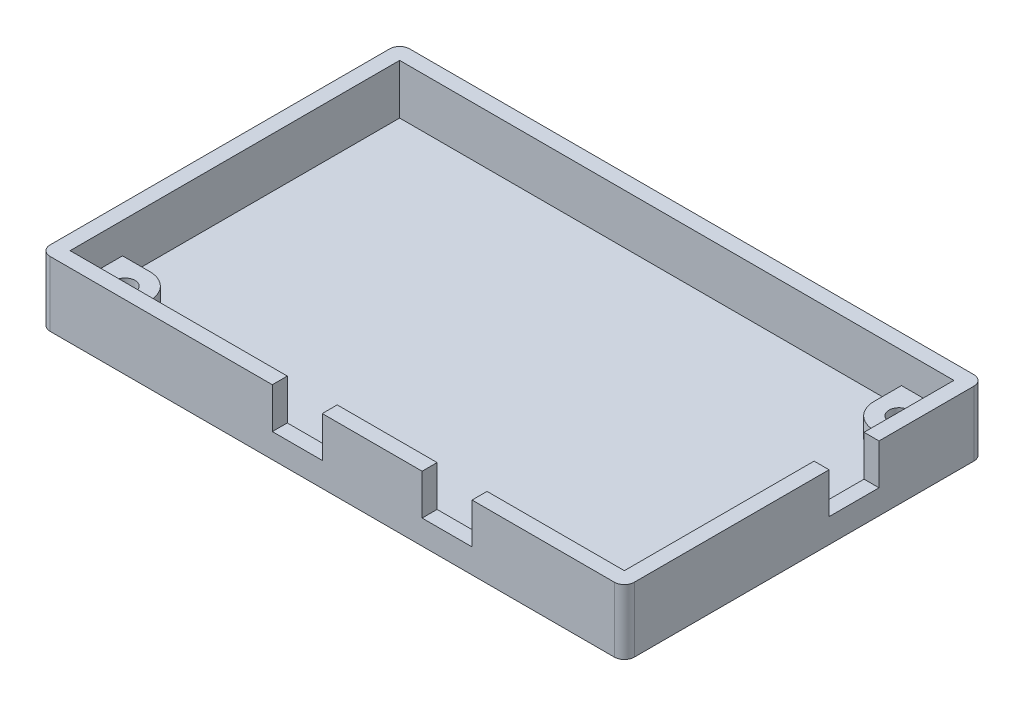
ISO-10303-21;
HEADER;
FILE_DESCRIPTION(('STEP AP214'),'2;1');
FILE_NAME('part.step','',(''),(''),'','','');
FILE_SCHEMA(('AUTOMOTIVE_DESIGN { 1 0 10303 214 1 1 1 1 }'));
ENDSEC;
DATA;
#1=APPLICATION_CONTEXT('core data for automotive mechanical design processes');
#2=APPLICATION_PROTOCOL_DEFINITION('international standard','automotive_design',2000,#1);
#3=PRODUCT_CONTEXT('',#1,'mechanical');
#4=PRODUCT('Part','Part','',(#3));
#5=PRODUCT_RELATED_PRODUCT_CATEGORY('part','',(#4));
#6=PRODUCT_DEFINITION_FORMATION('','',#4);
#7=PRODUCT_DEFINITION_CONTEXT('part definition',#1,'design');
#8=PRODUCT_DEFINITION('design','',#6,#7);
#9=PRODUCT_DEFINITION_SHAPE('','',#8);
#10=(LENGTH_UNIT() NAMED_UNIT(*) SI_UNIT(.MILLI.,.METRE.));
#11=(NAMED_UNIT(*) PLANE_ANGLE_UNIT() SI_UNIT($,.RADIAN.));
#12=(NAMED_UNIT(*) SI_UNIT($,.STERADIAN.) SOLID_ANGLE_UNIT());
#13=UNCERTAINTY_MEASURE_WITH_UNIT(LENGTH_MEASURE(1.E-05),#10,'distance_accuracy_value','');
#14=(GEOMETRIC_REPRESENTATION_CONTEXT(3) GLOBAL_UNCERTAINTY_ASSIGNED_CONTEXT((#13)) GLOBAL_UNIT_ASSIGNED_CONTEXT((#10,
#11,#12)) REPRESENTATION_CONTEXT('',''));
#15=CARTESIAN_POINT('',(0.,0.,0.));
#16=DIRECTION('',(0.,0.,1.));
#17=DIRECTION('',(1.,0.,0.));
#18=AXIS2_PLACEMENT_3D('',#15,#16,#17);
#19=CARTESIAN_POINT('',(0.,10.,0.));
#20=DIRECTION('',(0.,1.,0.));
#21=DIRECTION('',(0.,0.,1.));
#22=AXIS2_PLACEMENT_3D('',#19,#20,#21);
#23=PLANE('',#22);
#24=DIRECTION('',(0.,0.,-1.));
#25=VECTOR('',#24,1.);
#26=CARTESIAN_POINT('',(83.,10.,3.5));
#27=LINE('',#26,#25);
#28=CARTESIAN_POINT('',(83.,10.,3.5));
#29=VERTEX_POINT('',#28);
#30=CARTESIAN_POINT('',(83.,10.,0.5));
#31=VERTEX_POINT('',#30);
#32=EDGE_CURVE('E278',#29,#31,#27,.T.);
#33=ORIENTED_EDGE('',*,*,#32,.F.);
#34=DIRECTION('',(1.,0.,0.));
#35=VECTOR('',#34,1.);
#36=CARTESIAN_POINT('',(0.,10.,3.5));
#37=LINE('',#36,#35);
#38=CARTESIAN_POINT('',(111.5,10.,3.5));
#39=VERTEX_POINT('',#38);
#40=EDGE_CURVE('E268',#29,#39,#37,.T.);
#41=ORIENTED_EDGE('',*,*,#40,.T.);
#42=CARTESIAN_POINT('',(111.5,10.,1.5));
#43=DIRECTION('',(0.,1.,0.));
#44=DIRECTION('',(0.,0.,1.));
#45=AXIS2_PLACEMENT_3D('',#42,#43,#44);
#46=CIRCLE('',#45,2.);
#47=CARTESIAN_POINT('',(113.5,10.,1.5));
#48=VERTEX_POINT('',#47);
#49=EDGE_CURVE('E477',#39,#48,#46,.T.);
#50=ORIENTED_EDGE('',*,*,#49,.T.);
#51=DIRECTION('',(0.,0.,-1.));
#52=VECTOR('',#51,1.);
#53=CARTESIAN_POINT('',(113.5,10.,0.));
#54=LINE('',#53,#52);
#55=CARTESIAN_POINT('',(113.5,10.,-37.5));
#56=VERTEX_POINT('',#55);
#57=EDGE_CURVE('E415',#48,#56,#54,.T.);
#58=ORIENTED_EDGE('',*,*,#57,.T.);
#59=DIRECTION('',(-1.,0.,0.));
#60=VECTOR('',#59,1.);
#61=CARTESIAN_POINT('',(113.5,10.,-37.5));
#62=LINE('',#61,#60);
#63=CARTESIAN_POINT('',(110.5,10.,-37.5));
#64=VERTEX_POINT('',#63);
#65=EDGE_CURVE('E330',#56,#64,#62,.T.);
#66=ORIENTED_EDGE('',*,*,#65,.T.);
#67=DIRECTION('',(0.,0.,-1.));
#68=VECTOR('',#67,1.);
#69=CARTESIAN_POINT('',(110.5,10.,0.));
#70=LINE('',#69,#68);
#71=CARTESIAN_POINT('',(110.5,10.,0.5));
#72=VERTEX_POINT('',#71);
#73=EDGE_CURVE('E433',#72,#64,#70,.T.);
#74=ORIENTED_EDGE('',*,*,#73,.F.);
#75=DIRECTION('',(1.,0.,0.));
#76=VECTOR('',#75,1.);
#77=CARTESIAN_POINT('',(0.,10.,0.5));
#78=LINE('',#77,#76);
#79=EDGE_CURVE('E421',#31,#72,#78,.T.);
#80=ORIENTED_EDGE('',*,*,#79,.F.);
#81=EDGE_LOOP('',(#33,#41,#50,#58,#66,#74,#80));
#82=FACE_BOUND('',#81,.T.);
#83=ADVANCED_FACE('F39',(#82),#23,.T.);
#84=DIRECTION('',(0.,0.,-1.));
#85=VECTOR('',#84,1.);
#86=CARTESIAN_POINT('',(73.,10.,3.5));
#87=LINE('',#86,#85);
#88=CARTESIAN_POINT('',(73.,10.,3.5));
#89=VERTEX_POINT('',#88);
#90=CARTESIAN_POINT('',(73.,10.,0.5));
#91=VERTEX_POINT('',#90);
#92=EDGE_CURVE('E281',#89,#91,#87,.T.);
#93=ORIENTED_EDGE('',*,*,#92,.T.);
#94=CARTESIAN_POINT('',(53.,10.,0.5));
#95=VERTEX_POINT('',#94);
#96=EDGE_CURVE('E426',#95,#91,#78,.T.);
#97=ORIENTED_EDGE('',*,*,#96,.F.);
#98=DIRECTION('',(0.,0.,-1.));
#99=VECTOR('',#98,1.);
#100=CARTESIAN_POINT('',(53.,10.,3.5));
#101=LINE('',#100,#99);
#102=CARTESIAN_POINT('',(53.,10.,3.5));
#103=VERTEX_POINT('',#102);
#104=EDGE_CURVE('E276',#103,#95,#101,.T.);
#105=ORIENTED_EDGE('',*,*,#104,.F.);
#106=EDGE_CURVE('E414',#103,#89,#37,.T.);
#107=ORIENTED_EDGE('',*,*,#106,.T.);
#108=EDGE_LOOP('',(#93,#97,#105,#107));
#109=FACE_BOUND('',#108,.T.);
#110=ADVANCED_FACE('F544',(#109),#23,.T.);
#111=CARTESIAN_POINT('',(110.5,10.,0.));
#112=DIRECTION('',(-1.,0.,0.));
#113=DIRECTION('',(0.,0.,1.));
#114=AXIS2_PLACEMENT_3D('',#111,#112,#113);
#115=PLANE('',#114);
#116=ORIENTED_EDGE('',*,*,#73,.T.);
#117=DIRECTION('',(0.,-1.,0.));
#118=VECTOR('',#117,1.);
#119=CARTESIAN_POINT('',(110.5,10.,-37.5));
#120=LINE('',#119,#118);
#121=CARTESIAN_POINT('',(110.5,1.87,-37.5));
#122=VERTEX_POINT('',#121);
#123=EDGE_CURVE('E280',#64,#122,#120,.T.);
#124=ORIENTED_EDGE('',*,*,#123,.T.);
#125=DIRECTION('',(0.,0.,1.));
#126=VECTOR('',#125,1.);
#127=CARTESIAN_POINT('',(110.5,1.87,-47.5));
#128=LINE('',#127,#126);
#129=CARTESIAN_POINT('',(110.5,1.87,-47.5));
#130=VERTEX_POINT('',#129);
#131=EDGE_CURVE('E320',#130,#122,#128,.T.);
#132=ORIENTED_EDGE('',*,*,#131,.F.);
#133=DIRECTION('',(0.,-1.,0.));
#134=VECTOR('',#133,1.);
#135=CARTESIAN_POINT('',(110.5,10.,-47.5));
#136=LINE('',#135,#134);
#137=CARTESIAN_POINT('',(110.5,10.,-47.5));
#138=VERTEX_POINT('',#137);
#139=EDGE_CURVE('E311',#138,#130,#136,.T.);
#140=ORIENTED_EDGE('',*,*,#139,.F.);
#141=CARTESIAN_POINT('',(110.5,10.,-65.5));
#142=VERTEX_POINT('',#141);
#143=EDGE_CURVE('E432',#138,#142,#70,.T.);
#144=ORIENTED_EDGE('',*,*,#143,.T.);
#145=DIRECTION('',(0.,-1.,0.));
#146=VECTOR('',#145,1.);
#147=CARTESIAN_POINT('',(110.5,10.,-65.5));
#148=LINE('',#147,#146);
#149=CARTESIAN_POINT('',(110.5,3.85,-65.5));
#150=VERTEX_POINT('',#149);
#151=EDGE_CURVE('E447',#142,#150,#148,.T.);
#152=ORIENTED_EDGE('',*,*,#151,.T.);
#153=DIRECTION('',(0.,0.,-1.));
#154=VECTOR('',#153,1.);
#155=CARTESIAN_POINT('',(110.5,3.85,-65.5));
#156=LINE('',#155,#154);
#157=CARTESIAN_POINT('',(110.5,3.85,-55.));
#158=VERTEX_POINT('',#157);
#159=EDGE_CURVE('E379',#158,#150,#156,.T.);
#160=ORIENTED_EDGE('',*,*,#159,.F.);
#161=DIRECTION('',(0.,-1.,0.));
#162=VECTOR('',#161,1.);
#163=CARTESIAN_POINT('',(110.5,3.85,-55.));
#164=LINE('',#163,#162);
#165=CARTESIAN_POINT('',(110.5,0.,-55.));
#166=VERTEX_POINT('',#165);
#167=EDGE_CURVE('E390',#158,#166,#164,.T.);
#168=ORIENTED_EDGE('',*,*,#167,.T.);
#169=DIRECTION('',(0.,0.,-1.));
#170=VECTOR('',#169,1.);
#171=CARTESIAN_POINT('',(110.5,0.,0.));
#172=LINE('',#171,#170);
#173=CARTESIAN_POINT('',(110.5,0.,0.5));
#174=VERTEX_POINT('',#173);
#175=EDGE_CURVE('E409',#174,#166,#172,.T.);
#176=ORIENTED_EDGE('',*,*,#175,.F.);
#177=DIRECTION('',(0.,-1.,0.));
#178=VECTOR('',#177,1.);
#179=CARTESIAN_POINT('',(110.5,10.,0.5));
#180=LINE('',#179,#178);
#181=EDGE_CURVE('E436',#72,#174,#180,.T.);
#182=ORIENTED_EDGE('',*,*,#181,.F.);
#183=EDGE_LOOP('',(#116,#124,#132,#140,#144,#152,#160,#168,#176,#182));
#184=FACE_BOUND('',#183,.T.);
#185=ADVANCED_FACE('F550',(#184),#115,.T.);
#186=CARTESIAN_POINT('',(113.5,-3.,0.));
#187=DIRECTION('',(1.,0.,0.));
#188=DIRECTION('',(0.,0.,-1.));
#189=AXIS2_PLACEMENT_3D('',#186,#187,#188);
#190=PLANE('',#189);
#191=DIRECTION('',(0.,0.,1.));
#192=VECTOR('',#191,1.);
#193=CARTESIAN_POINT('',(113.5,1.87,-47.5));
#194=LINE('',#193,#192);
#195=CARTESIAN_POINT('',(113.5,1.87,-47.5));
#196=VERTEX_POINT('',#195);
#197=CARTESIAN_POINT('',(113.5,1.87,-37.5));
#198=VERTEX_POINT('',#197);
#199=EDGE_CURVE('E310',#196,#198,#194,.T.);
#200=ORIENTED_EDGE('',*,*,#199,.T.);
#201=DIRECTION('',(0.,-1.,0.));
#202=VECTOR('',#201,1.);
#203=CARTESIAN_POINT('',(113.5,10.,-37.5));
#204=LINE('',#203,#202);
#205=EDGE_CURVE('E308',#56,#198,#204,.T.);
#206=ORIENTED_EDGE('',*,*,#205,.F.);
#207=ORIENTED_EDGE('',*,*,#57,.F.);
#208=DIRECTION('',(0.,1.,0.));
#209=VECTOR('',#208,1.);
#210=CARTESIAN_POINT('',(113.5,-3.,1.5));
#211=LINE('',#210,#209);
#212=CARTESIAN_POINT('',(113.5,-3.,1.5));
#213=VERTEX_POINT('',#212);
#214=EDGE_CURVE('E482',#48,#213,#211,.F.);
#215=ORIENTED_EDGE('',*,*,#214,.T.);
#216=DIRECTION('',(0.,0.,-1.));
#217=VECTOR('',#216,1.);
#218=CARTESIAN_POINT('',(113.5,-3.,0.));
#219=LINE('',#218,#217);
#220=CARTESIAN_POINT('',(113.5,-3.,-66.5));
#221=VERTEX_POINT('',#220);
#222=EDGE_CURVE('E461',#213,#221,#219,.T.);
#223=ORIENTED_EDGE('',*,*,#222,.T.);
#224=DIRECTION('',(0.,1.,0.));
#225=VECTOR('',#224,1.);
#226=CARTESIAN_POINT('',(113.5,10.,-66.5));
#227=LINE('',#226,#225);
#228=CARTESIAN_POINT('',(113.5,10.,-66.5));
#229=VERTEX_POINT('',#228);
#230=EDGE_CURVE('E479',#221,#229,#227,.T.);
#231=ORIENTED_EDGE('',*,*,#230,.T.);
#232=CARTESIAN_POINT('',(113.5,10.,-47.5));
#233=VERTEX_POINT('',#232);
#234=EDGE_CURVE('E413',#233,#229,#54,.T.);
#235=ORIENTED_EDGE('',*,*,#234,.F.);
#236=DIRECTION('',(0.,-1.,0.));
#237=VECTOR('',#236,1.);
#238=CARTESIAN_POINT('',(113.5,10.,-47.5));
#239=LINE('',#238,#237);
#240=EDGE_CURVE('E314',#233,#196,#239,.T.);
#241=ORIENTED_EDGE('',*,*,#240,.T.);
#242=EDGE_LOOP('',(#200,#206,#207,#215,#223,#231,#235,#241));
#243=FACE_BOUND('',#242,.T.);
#244=ADVANCED_FACE('F512',(#243),#190,.T.);
#245=DIRECTION('',(0.,0.,-1.));
#246=VECTOR('',#245,1.);
#247=CARTESIAN_POINT('',(43.,10.,3.5));
#248=LINE('',#247,#246);
#249=CARTESIAN_POINT('',(43.,10.,3.5));
#250=VERTEX_POINT('',#249);
#251=CARTESIAN_POINT('',(43.,10.,0.5));
#252=VERTEX_POINT('',#251);
#253=EDGE_CURVE('E302',#250,#252,#248,.T.);
#254=ORIENTED_EDGE('',*,*,#253,.T.);
#255=CARTESIAN_POINT('',(-0.5,10.,0.5));
#256=VERTEX_POINT('',#255);
#257=EDGE_CURVE('E422',#256,#252,#78,.T.);
#258=ORIENTED_EDGE('',*,*,#257,.F.);
#259=DIRECTION('',(0.,0.,-1.));
#260=VECTOR('',#259,1.);
#261=CARTESIAN_POINT('',(-0.5,10.,0.));
#262=LINE('',#261,#260);
#263=CARTESIAN_POINT('',(-0.5,10.,-65.5));
#264=VERTEX_POINT('',#263);
#265=EDGE_CURVE('E425',#256,#264,#262,.T.);
#266=ORIENTED_EDGE('',*,*,#265,.T.);
#267=DIRECTION('',(1.,0.,0.));
#268=VECTOR('',#267,1.);
#269=CARTESIAN_POINT('',(0.,10.,-65.5));
#270=LINE('',#269,#268);
#271=EDGE_CURVE('E429',#264,#142,#270,.T.);
#272=ORIENTED_EDGE('',*,*,#271,.T.);
#273=ORIENTED_EDGE('',*,*,#143,.F.);
#274=DIRECTION('',(-1.,0.,0.));
#275=VECTOR('',#274,1.);
#276=CARTESIAN_POINT('',(113.5,10.,-47.5));
#277=LINE('',#276,#275);
#278=EDGE_CURVE('E317',#233,#138,#277,.T.);
#279=ORIENTED_EDGE('',*,*,#278,.F.);
#280=ORIENTED_EDGE('',*,*,#234,.T.);
#281=CARTESIAN_POINT('',(111.5,10.,-66.5));
#282=DIRECTION('',(0.,1.,0.));
#283=DIRECTION('',(0.,0.,1.));
#284=AXIS2_PLACEMENT_3D('',#281,#282,#283);
#285=CIRCLE('',#284,2.);
#286=CARTESIAN_POINT('',(111.5,10.,-68.5));
#287=VERTEX_POINT('',#286);
#288=EDGE_CURVE('E471',#229,#287,#285,.T.);
#289=ORIENTED_EDGE('',*,*,#288,.T.);
#290=DIRECTION('',(1.,0.,0.));
#291=VECTOR('',#290,1.);
#292=CARTESIAN_POINT('',(0.,10.,-68.5));
#293=LINE('',#292,#291);
#294=CARTESIAN_POINT('',(-1.5,10.,-68.5));
#295=VERTEX_POINT('',#294);
#296=EDGE_CURVE('E418',#295,#287,#293,.T.);
#297=ORIENTED_EDGE('',*,*,#296,.F.);
#298=CARTESIAN_POINT('',(-1.5,10.,-66.5));
#299=DIRECTION('',(0.,1.,0.));
#300=DIRECTION('',(0.,0.,1.));
#301=AXIS2_PLACEMENT_3D('',#298,#299,#300);
#302=CIRCLE('',#301,2.);
#303=CARTESIAN_POINT('',(-3.5,10.,-66.5));
#304=VERTEX_POINT('',#303);
#305=EDGE_CURVE('E473',#295,#304,#302,.T.);
#306=ORIENTED_EDGE('',*,*,#305,.T.);
#307=DIRECTION('',(0.,0.,-1.));
#308=VECTOR('',#307,1.);
#309=CARTESIAN_POINT('',(-3.5,10.,0.));
#310=LINE('',#309,#308);
#311=CARTESIAN_POINT('',(-3.5,10.,1.5));
#312=VERTEX_POINT('',#311);
#313=EDGE_CURVE('E406',#312,#304,#310,.T.);
#314=ORIENTED_EDGE('',*,*,#313,.F.);
#315=CARTESIAN_POINT('',(-1.5,10.,1.5));
#316=DIRECTION('',(0.,1.,0.));
#317=DIRECTION('',(0.,0.,1.));
#318=AXIS2_PLACEMENT_3D('',#315,#316,#317);
#319=CIRCLE('',#318,2.);
#320=CARTESIAN_POINT('',(-1.5,10.,3.5));
#321=VERTEX_POINT('',#320);
#322=EDGE_CURVE('E475',#312,#321,#319,.T.);
#323=ORIENTED_EDGE('',*,*,#322,.T.);
#324=EDGE_CURVE('E410',#321,#250,#37,.T.);
#325=ORIENTED_EDGE('',*,*,#324,.T.);
#326=EDGE_LOOP('',(#254,#258,#266,#272,#273,#279,#280,#289,#297,#306,#314,#323,#325));
#327=FACE_BOUND('',#326,.T.);
#328=ADVANCED_FACE('F533',(#327),#23,.T.);
#329=CARTESIAN_POINT('',(0.,0.,0.));
#330=DIRECTION('',(0.,1.,0.));
#331=DIRECTION('',(0.,0.,1.));
#332=AXIS2_PLACEMENT_3D('',#329,#330,#331);
#333=PLANE('',#332);
#334=CARTESIAN_POINT('',(5.,0.,-5.));
#335=DIRECTION('',(0.,1.,0.));
#336=DIRECTION('',(0.,0.,-1.));
#337=AXIS2_PLACEMENT_3D('',#334,#335,#336);
#338=CIRCLE('',#337,5.);
#339=CARTESIAN_POINT('',(10.,0.,-4.99999999999997));
#340=VERTEX_POINT('',#339);
#341=CARTESIAN_POINT('',(4.99999999999997,0.,-10.));
#342=VERTEX_POINT('',#341);
#343=EDGE_CURVE('E363',#340,#342,#338,.T.);
#344=ORIENTED_EDGE('',*,*,#343,.F.);
#345=DIRECTION('',(0.,0.,-1.));
#346=VECTOR('',#345,1.);
#347=CARTESIAN_POINT('',(10.,0.,0.5));
#348=LINE('',#347,#346);
#349=CARTESIAN_POINT('',(10.,0.,0.5));
#350=VERTEX_POINT('',#349);
#351=EDGE_CURVE('E337',#350,#340,#348,.T.);
#352=ORIENTED_EDGE('',*,*,#351,.F.);
#353=DIRECTION('',(1.,0.,0.));
#354=VECTOR('',#353,1.);
#355=CARTESIAN_POINT('',(0.,0.,0.5));
#356=LINE('',#355,#354);
#357=EDGE_CURVE('E405',#350,#174,#356,.T.);
#358=ORIENTED_EDGE('',*,*,#357,.T.);
#359=ORIENTED_EDGE('',*,*,#175,.T.);
#360=DIRECTION('',(1.,0.,0.));
#361=VECTOR('',#360,1.);
#362=CARTESIAN_POINT('',(110.5,0.,-55.));
#363=LINE('',#362,#361);
#364=CARTESIAN_POINT('',(105.,0.,-55.));
#365=VERTEX_POINT('',#364);
#366=EDGE_CURVE('E382',#365,#166,#363,.T.);
#367=ORIENTED_EDGE('',*,*,#366,.F.);
#368=CARTESIAN_POINT('',(105.,0.,-60.));
#369=DIRECTION('',(0.,1.,0.));
#370=DIRECTION('',(0.,0.,-1.));
#371=AXIS2_PLACEMENT_3D('',#368,#369,#370);
#372=CIRCLE('',#371,5.);
#373=CARTESIAN_POINT('',(100.,0.,-60.));
#374=VERTEX_POINT('',#373);
#375=EDGE_CURVE('E392',#374,#365,#372,.T.);
#376=ORIENTED_EDGE('',*,*,#375,.F.);
#377=DIRECTION('',(0.,0.,1.));
#378=VECTOR('',#377,1.);
#379=CARTESIAN_POINT('',(100.,0.,-65.5));
#380=LINE('',#379,#378);
#381=CARTESIAN_POINT('',(100.,0.,-65.5));
#382=VERTEX_POINT('',#381);
#383=EDGE_CURVE('E378',#382,#374,#380,.T.);
#384=ORIENTED_EDGE('',*,*,#383,.F.);
#385=DIRECTION('',(1.,0.,0.));
#386=VECTOR('',#385,1.);
#387=CARTESIAN_POINT('',(0.,0.,-65.5));
#388=LINE('',#387,#386);
#389=CARTESIAN_POINT('',(-0.5,0.,-65.5));
#390=VERTEX_POINT('',#389);
#391=EDGE_CURVE('E440',#390,#382,#388,.T.);
#392=ORIENTED_EDGE('',*,*,#391,.F.);
#393=DIRECTION('',(0.,0.,-1.));
#394=VECTOR('',#393,1.);
#395=CARTESIAN_POINT('',(-0.5,0.,0.));
#396=LINE('',#395,#394);
#397=CARTESIAN_POINT('',(-0.5,0.,-10.));
#398=VERTEX_POINT('',#397);
#399=EDGE_CURVE('E438',#398,#390,#396,.T.);
#400=ORIENTED_EDGE('',*,*,#399,.F.);
#401=DIRECTION('',(-1.,0.,0.));
#402=VECTOR('',#401,1.);
#403=CARTESIAN_POINT('',(-0.5,0.,-10.));
#404=LINE('',#403,#402);
#405=EDGE_CURVE('E350',#342,#398,#404,.T.);
#406=ORIENTED_EDGE('',*,*,#405,.F.);
#407=EDGE_LOOP('',(#344,#352,#358,#359,#367,#376,#384,#392,#400,#406));
#408=FACE_BOUND('',#407,.T.);
#409=ADVANCED_FACE('F555',(#408),#333,.T.);
#410=CARTESIAN_POINT('',(0.,10.,0.5));
#411=DIRECTION('',(0.,0.,-1.));
#412=DIRECTION('',(-1.,0.,0.));
#413=AXIS2_PLACEMENT_3D('',#410,#411,#412);
#414=PLANE('',#413);
#415=DIRECTION('',(0.,-1.,0.));
#416=VECTOR('',#415,1.);
#417=CARTESIAN_POINT('',(83.,10.,0.5));
#418=LINE('',#417,#416);
#419=CARTESIAN_POINT('',(83.,1.87,0.5));
#420=VERTEX_POINT('',#419);
#421=EDGE_CURVE('E254',#31,#420,#418,.T.);
#422=ORIENTED_EDGE('',*,*,#421,.F.);
#423=ORIENTED_EDGE('',*,*,#79,.T.);
#424=ORIENTED_EDGE('',*,*,#181,.T.);
#425=ORIENTED_EDGE('',*,*,#357,.F.);
#426=DIRECTION('',(0.,-1.,0.));
#427=VECTOR('',#426,1.);
#428=CARTESIAN_POINT('',(10.,3.85,0.5));
#429=LINE('',#428,#427);
#430=CARTESIAN_POINT('',(10.,3.85,0.5));
#431=VERTEX_POINT('',#430);
#432=EDGE_CURVE('E375',#431,#350,#429,.T.);
#433=ORIENTED_EDGE('',*,*,#432,.F.);
#434=DIRECTION('',(1.,0.,0.));
#435=VECTOR('',#434,1.);
#436=CARTESIAN_POINT('',(-0.5,3.85,0.5));
#437=LINE('',#436,#435);
#438=CARTESIAN_POINT('',(-0.5,3.85,0.5));
#439=VERTEX_POINT('',#438);
#440=EDGE_CURVE('E349',#439,#431,#437,.T.);
#441=ORIENTED_EDGE('',*,*,#440,.F.);
#442=DIRECTION('',(0.,-1.,0.));
#443=VECTOR('',#442,1.);
#444=CARTESIAN_POINT('',(-0.5,10.,0.5));
#445=LINE('',#444,#443);
#446=EDGE_CURVE('E453',#256,#439,#445,.T.);
#447=ORIENTED_EDGE('',*,*,#446,.F.);
#448=ORIENTED_EDGE('',*,*,#257,.T.);
#449=DIRECTION('',(0.,1.,0.));
#450=VECTOR('',#449,1.);
#451=CARTESIAN_POINT('',(43.,10.,0.5));
#452=LINE('',#451,#450);
#453=CARTESIAN_POINT('',(43.,1.87,0.5));
#454=VERTEX_POINT('',#453);
#455=EDGE_CURVE('E289',#454,#252,#452,.T.);
#456=ORIENTED_EDGE('',*,*,#455,.F.);
#457=DIRECTION('',(-1.,0.,0.));
#458=VECTOR('',#457,1.);
#459=CARTESIAN_POINT('',(53.,1.87,0.5));
#460=LINE('',#459,#458);
#461=CARTESIAN_POINT('',(53.,1.87,0.5));
#462=VERTEX_POINT('',#461);
#463=EDGE_CURVE('E297',#462,#454,#460,.T.);
#464=ORIENTED_EDGE('',*,*,#463,.F.);
#465=DIRECTION('',(0.,-1.,0.));
#466=VECTOR('',#465,1.);
#467=CARTESIAN_POINT('',(53.,10.,0.5));
#468=LINE('',#467,#466);
#469=EDGE_CURVE('E294',#95,#462,#468,.T.);
#470=ORIENTED_EDGE('',*,*,#469,.F.);
#471=ORIENTED_EDGE('',*,*,#96,.T.);
#472=DIRECTION('',(0.,1.,0.));
#473=VECTOR('',#472,1.);
#474=CARTESIAN_POINT('',(73.,10.,0.5));
#475=LINE('',#474,#473);
#476=CARTESIAN_POINT('',(73.,1.87,0.5));
#477=VERTEX_POINT('',#476);
#478=EDGE_CURVE('E269',#477,#91,#475,.T.);
#479=ORIENTED_EDGE('',*,*,#478,.F.);
#480=DIRECTION('',(-1.,0.,0.));
#481=VECTOR('',#480,1.);
#482=CARTESIAN_POINT('',(83.,1.87,0.5));
#483=LINE('',#482,#481);
#484=EDGE_CURVE('E271',#420,#477,#483,.T.);
#485=ORIENTED_EDGE('',*,*,#484,.F.);
#486=EDGE_LOOP('',(#422,#423,#424,#425,#433,#441,#447,#448,#456,#464,#470,#471,#479,#485));
#487=FACE_BOUND('',#486,.T.);
#488=ADVANCED_FACE('F560',(#487),#414,.T.);
#489=CARTESIAN_POINT('',(-0.5,10.,0.));
#490=DIRECTION('',(-1.,0.,0.));
#491=DIRECTION('',(0.,0.,1.));
#492=AXIS2_PLACEMENT_3D('',#489,#490,#491);
#493=PLANE('',#492);
#494=DIRECTION('',(0.,-1.,0.));
#495=VECTOR('',#494,1.);
#496=CARTESIAN_POINT('',(-0.5,3.85,-10.));
#497=LINE('',#496,#495);
#498=CARTESIAN_POINT('',(-0.5,3.85,-10.));
#499=VERTEX_POINT('',#498);
#500=EDGE_CURVE('E360',#499,#398,#497,.T.);
#501=ORIENTED_EDGE('',*,*,#500,.T.);
#502=ORIENTED_EDGE('',*,*,#399,.T.);
#503=DIRECTION('',(0.,-1.,0.));
#504=VECTOR('',#503,1.);
#505=CARTESIAN_POINT('',(-0.5,10.,-65.5));
#506=LINE('',#505,#504);
#507=EDGE_CURVE('E450',#264,#390,#506,.T.);
#508=ORIENTED_EDGE('',*,*,#507,.F.);
#509=ORIENTED_EDGE('',*,*,#265,.F.);
#510=ORIENTED_EDGE('',*,*,#446,.T.);
#511=DIRECTION('',(0.,0.,1.));
#512=VECTOR('',#511,1.);
#513=CARTESIAN_POINT('',(-0.5,3.85,0.5));
#514=LINE('',#513,#512);
#515=EDGE_CURVE('E346',#499,#439,#514,.T.);
#516=ORIENTED_EDGE('',*,*,#515,.F.);
#517=EDGE_LOOP('',(#501,#502,#508,#509,#510,#516));
#518=FACE_BOUND('',#517,.T.);
#519=ADVANCED_FACE('F664',(#518),#493,.F.);
#520=CARTESIAN_POINT('',(0.,10.,-65.5));
#521=DIRECTION('',(0.,0.,-1.));
#522=DIRECTION('',(-1.,0.,0.));
#523=AXIS2_PLACEMENT_3D('',#520,#521,#522);
#524=PLANE('',#523);
#525=DIRECTION('',(0.,-1.,0.));
#526=VECTOR('',#525,1.);
#527=CARTESIAN_POINT('',(100.,3.85,-65.5));
#528=LINE('',#527,#526);
#529=CARTESIAN_POINT('',(100.,3.85,-65.5));
#530=VERTEX_POINT('',#529);
#531=EDGE_CURVE('E403',#530,#382,#528,.T.);
#532=ORIENTED_EDGE('',*,*,#531,.F.);
#533=DIRECTION('',(-1.,0.,0.));
#534=VECTOR('',#533,1.);
#535=CARTESIAN_POINT('',(110.5,3.85,-65.5));
#536=LINE('',#535,#534);
#537=EDGE_CURVE('E381',#150,#530,#536,.T.);
#538=ORIENTED_EDGE('',*,*,#537,.F.);
#539=ORIENTED_EDGE('',*,*,#151,.F.);
#540=ORIENTED_EDGE('',*,*,#271,.F.);
#541=ORIENTED_EDGE('',*,*,#507,.T.);
#542=ORIENTED_EDGE('',*,*,#391,.T.);
#543=EDGE_LOOP('',(#532,#538,#539,#540,#541,#542));
#544=FACE_BOUND('',#543,.T.);
#545=ADVANCED_FACE('F574',(#544),#524,.F.);
#546=CARTESIAN_POINT('',(-3.5,-3.,0.));
#547=DIRECTION('',(1.,0.,0.));
#548=DIRECTION('',(0.,0.,-1.));
#549=AXIS2_PLACEMENT_3D('',#546,#547,#548);
#550=PLANE('',#549);
#551=DIRECTION('',(0.,0.,-1.));
#552=VECTOR('',#551,1.);
#553=CARTESIAN_POINT('',(-3.5,-3.,0.));
#554=LINE('',#553,#552);
#555=CARTESIAN_POINT('',(-3.5,-3.,1.5));
#556=VERTEX_POINT('',#555);
#557=CARTESIAN_POINT('',(-3.5,-3.,-66.5));
#558=VERTEX_POINT('',#557);
#559=EDGE_CURVE('E455',#556,#558,#554,.T.);
#560=ORIENTED_EDGE('',*,*,#559,.F.);
#561=DIRECTION('',(0.,1.,0.));
#562=VECTOR('',#561,1.);
#563=CARTESIAN_POINT('',(-3.5,10.,1.5));
#564=LINE('',#563,#562);
#565=EDGE_CURVE('E494',#556,#312,#564,.T.);
#566=ORIENTED_EDGE('',*,*,#565,.T.);
#567=ORIENTED_EDGE('',*,*,#313,.T.);
#568=DIRECTION('',(0.,1.,0.));
#569=VECTOR('',#568,1.);
#570=CARTESIAN_POINT('',(-3.5,-3.,-66.5));
#571=LINE('',#570,#569);
#572=EDGE_CURVE('E492',#304,#558,#571,.F.);
#573=ORIENTED_EDGE('',*,*,#572,.T.);
#574=EDGE_LOOP('',(#560,#566,#567,#573));
#575=FACE_BOUND('',#574,.T.);
#576=ADVANCED_FACE('F530',(#575),#550,.F.);
#577=CARTESIAN_POINT('',(0.,-3.,-68.5));
#578=DIRECTION('',(0.,0.,1.));
#579=DIRECTION('',(1.,0.,0.));
#580=AXIS2_PLACEMENT_3D('',#577,#578,#579);
#581=PLANE('',#580);
#582=DIRECTION('',(1.,0.,0.));
#583=VECTOR('',#582,1.);
#584=CARTESIAN_POINT('',(0.,-3.,-68.5));
#585=LINE('',#584,#583);
#586=CARTESIAN_POINT('',(-1.5,-3.,-68.5));
#587=VERTEX_POINT('',#586);
#588=CARTESIAN_POINT('',(111.5,-3.,-68.5));
#589=VERTEX_POINT('',#588);
#590=EDGE_CURVE('E464',#587,#589,#585,.T.);
#591=ORIENTED_EDGE('',*,*,#590,.F.);
#592=DIRECTION('',(0.,1.,0.));
#593=VECTOR('',#592,1.);
#594=CARTESIAN_POINT('',(-1.5,-3.,-68.5));
#595=LINE('',#594,#593);
#596=EDGE_CURVE('E11',#587,#295,#595,.T.);
#597=ORIENTED_EDGE('',*,*,#596,.T.);
#598=ORIENTED_EDGE('',*,*,#296,.T.);
#599=DIRECTION('',(0.,1.,0.));
#600=VECTOR('',#599,1.);
#601=CARTESIAN_POINT('',(111.5,-3.,-68.5));
#602=LINE('',#601,#600);
#603=EDGE_CURVE('E47',#287,#589,#602,.F.);
#604=ORIENTED_EDGE('',*,*,#603,.T.);
#605=EDGE_LOOP('',(#591,#597,#598,#604));
#606=FACE_BOUND('',#605,.T.);
#607=ADVANCED_FACE('F499',(#606),#581,.F.);
#608=CARTESIAN_POINT('',(0.,-3.,3.5));
#609=DIRECTION('',(0.,0.,1.));
#610=DIRECTION('',(1.,0.,0.));
#611=AXIS2_PLACEMENT_3D('',#608,#609,#610);
#612=PLANE('',#611);
#613=DIRECTION('',(0.,-1.,0.));
#614=VECTOR('',#613,1.);
#615=CARTESIAN_POINT('',(83.,10.,3.5));
#616=LINE('',#615,#614);
#617=CARTESIAN_POINT('',(83.,1.87,3.5));
#618=VERTEX_POINT('',#617);
#619=EDGE_CURVE('E251',#29,#618,#616,.T.);
#620=ORIENTED_EDGE('',*,*,#619,.T.);
#621=DIRECTION('',(-1.,0.,0.));
#622=VECTOR('',#621,1.);
#623=CARTESIAN_POINT('',(83.,1.87,3.5));
#624=LINE('',#623,#622);
#625=CARTESIAN_POINT('',(73.,1.87,3.5));
#626=VERTEX_POINT('',#625);
#627=EDGE_CURVE('E261',#618,#626,#624,.T.);
#628=ORIENTED_EDGE('',*,*,#627,.T.);
#629=DIRECTION('',(0.,1.,0.));
#630=VECTOR('',#629,1.);
#631=CARTESIAN_POINT('',(73.,10.,3.5));
#632=LINE('',#631,#630);
#633=EDGE_CURVE('E54',#626,#89,#632,.T.);
#634=ORIENTED_EDGE('',*,*,#633,.T.);
#635=ORIENTED_EDGE('',*,*,#106,.F.);
#636=DIRECTION('',(0.,-1.,0.));
#637=VECTOR('',#636,1.);
#638=CARTESIAN_POINT('',(53.,10.,3.5));
#639=LINE('',#638,#637);
#640=CARTESIAN_POINT('',(53.,1.87,3.5));
#641=VERTEX_POINT('',#640);
#642=EDGE_CURVE('E285',#103,#641,#639,.T.);
#643=ORIENTED_EDGE('',*,*,#642,.T.);
#644=DIRECTION('',(-1.,0.,0.));
#645=VECTOR('',#644,1.);
#646=CARTESIAN_POINT('',(53.,1.87,3.5));
#647=LINE('',#646,#645);
#648=CARTESIAN_POINT('',(43.,1.87,3.5));
#649=VERTEX_POINT('',#648);
#650=EDGE_CURVE('E288',#641,#649,#647,.T.);
#651=ORIENTED_EDGE('',*,*,#650,.T.);
#652=DIRECTION('',(0.,1.,0.));
#653=VECTOR('',#652,1.);
#654=CARTESIAN_POINT('',(43.,10.,3.5));
#655=LINE('',#654,#653);
#656=EDGE_CURVE('E62',#649,#250,#655,.T.);
#657=ORIENTED_EDGE('',*,*,#656,.T.);
#658=ORIENTED_EDGE('',*,*,#324,.F.);
#659=DIRECTION('',(0.,1.,0.));
#660=VECTOR('',#659,1.);
#661=CARTESIAN_POINT('',(-1.5,-3.,3.5));
#662=LINE('',#661,#660);
#663=CARTESIAN_POINT('',(-1.5,-3.,3.5));
#664=VERTEX_POINT('',#663);
#665=EDGE_CURVE('E467',#321,#664,#662,.F.);
#666=ORIENTED_EDGE('',*,*,#665,.T.);
#667=DIRECTION('',(1.,0.,0.));
#668=VECTOR('',#667,1.);
#669=CARTESIAN_POINT('',(0.,-3.,3.5));
#670=LINE('',#669,#668);
#671=CARTESIAN_POINT('',(111.5,-3.,3.5));
#672=VERTEX_POINT('',#671);
#673=EDGE_CURVE('E458',#664,#672,#670,.T.);
#674=ORIENTED_EDGE('',*,*,#673,.T.);
#675=DIRECTION('',(0.,1.,0.));
#676=VECTOR('',#675,1.);
#677=CARTESIAN_POINT('',(111.5,-3.,3.5));
#678=LINE('',#677,#676);
#679=EDGE_CURVE('E469',#672,#39,#678,.T.);
#680=ORIENTED_EDGE('',*,*,#679,.T.);
#681=ORIENTED_EDGE('',*,*,#40,.F.);
#682=EDGE_LOOP('',(#620,#628,#634,#635,#643,#651,#657,#658,#666,#674,#680,#681));
#683=FACE_BOUND('',#682,.T.);
#684=ADVANCED_FACE('F266',(#683),#612,.T.);
#685=CARTESIAN_POINT('',(0.,-3.,0.));
#686=DIRECTION('',(0.,1.,0.));
#687=DIRECTION('',(0.,0.,1.));
#688=AXIS2_PLACEMENT_3D('',#685,#686,#687);
#689=PLANE('',#688);
#690=ORIENTED_EDGE('',*,*,#222,.F.);
#691=CARTESIAN_POINT('',(111.5,-3.,1.5));
#692=DIRECTION('',(0.,1.,0.));
#693=DIRECTION('',(0.,0.,1.));
#694=AXIS2_PLACEMENT_3D('',#691,#692,#693);
#695=CIRCLE('',#694,2.);
#696=EDGE_CURVE('E490',#213,#672,#695,.F.);
#697=ORIENTED_EDGE('',*,*,#696,.T.);
#698=ORIENTED_EDGE('',*,*,#673,.F.);
#699=CARTESIAN_POINT('',(-1.5,-3.,1.5));
#700=DIRECTION('',(0.,1.,0.));
#701=DIRECTION('',(0.,0.,1.));
#702=AXIS2_PLACEMENT_3D('',#699,#700,#701);
#703=CIRCLE('',#702,2.);
#704=EDGE_CURVE('E488',#664,#556,#703,.F.);
#705=ORIENTED_EDGE('',*,*,#704,.T.);
#706=ORIENTED_EDGE('',*,*,#559,.T.);
#707=CARTESIAN_POINT('',(-1.5,-3.,-66.5));
#708=DIRECTION('',(0.,1.,0.));
#709=DIRECTION('',(0.,0.,1.));
#710=AXIS2_PLACEMENT_3D('',#707,#708,#709);
#711=CIRCLE('',#710,2.);
#712=EDGE_CURVE('E486',#558,#587,#711,.F.);
#713=ORIENTED_EDGE('',*,*,#712,.T.);
#714=ORIENTED_EDGE('',*,*,#590,.T.);
#715=CARTESIAN_POINT('',(111.5,-3.,-66.5));
#716=DIRECTION('',(0.,1.,0.));
#717=DIRECTION('',(0.,0.,1.));
#718=AXIS2_PLACEMENT_3D('',#715,#716,#717);
#719=CIRCLE('',#718,2.);
#720=EDGE_CURVE('E484',#589,#221,#719,.F.);
#721=ORIENTED_EDGE('',*,*,#720,.T.);
#722=EDGE_LOOP('',(#690,#697,#698,#705,#706,#713,#714,#721));
#723=FACE_BOUND('',#722,.T.);
#724=ADVANCED_FACE('F507',(#723),#689,.F.);
#725=CARTESIAN_POINT('',(100.,3.85,-65.5));
#726=DIRECTION('',(1.,0.,0.));
#727=DIRECTION('',(0.,0.,-1.));
#728=AXIS2_PLACEMENT_3D('',#725,#726,#727);
#729=PLANE('',#728);
#730=ORIENTED_EDGE('',*,*,#383,.T.);
#731=DIRECTION('',(0.,-1.,0.));
#732=VECTOR('',#731,1.);
#733=CARTESIAN_POINT('',(100.,3.85,-60.));
#734=LINE('',#733,#732);
#735=CARTESIAN_POINT('',(100.,3.85,-60.));
#736=VERTEX_POINT('',#735);
#737=EDGE_CURVE('E400',#736,#374,#734,.T.);
#738=ORIENTED_EDGE('',*,*,#737,.F.);
#739=DIRECTION('',(0.,0.,1.));
#740=VECTOR('',#739,1.);
#741=CARTESIAN_POINT('',(100.,3.85,-65.5));
#742=LINE('',#741,#740);
#743=EDGE_CURVE('E384',#530,#736,#742,.T.);
#744=ORIENTED_EDGE('',*,*,#743,.F.);
#745=ORIENTED_EDGE('',*,*,#531,.T.);
#746=EDGE_LOOP('',(#730,#738,#744,#745));
#747=FACE_BOUND('',#746,.T.);
#748=ADVANCED_FACE('F625',(#747),#729,.F.);
#749=CARTESIAN_POINT('',(105.,3.85,-60.));
#750=DIRECTION('',(0.,-1.,0.));
#751=DIRECTION('',(0.,0.,-1.));
#752=AXIS2_PLACEMENT_3D('',#749,#750,#751);
#753=CYLINDRICAL_SURFACE('',#752,5.);
#754=ORIENTED_EDGE('',*,*,#375,.T.);
#755=DIRECTION('',(0.,-1.,0.));
#756=VECTOR('',#755,1.);
#757=CARTESIAN_POINT('',(105.,3.85,-55.));
#758=LINE('',#757,#756);
#759=CARTESIAN_POINT('',(105.,3.85,-55.));
#760=VERTEX_POINT('',#759);
#761=EDGE_CURVE('E398',#760,#365,#758,.T.);
#762=ORIENTED_EDGE('',*,*,#761,.F.);
#763=CARTESIAN_POINT('',(105.,3.85,-60.));
#764=DIRECTION('',(0.,1.,0.));
#765=DIRECTION('',(0.,0.,-1.));
#766=AXIS2_PLACEMENT_3D('',#763,#764,#765);
#767=CIRCLE('',#766,5.);
#768=EDGE_CURVE('E386',#736,#760,#767,.T.);
#769=ORIENTED_EDGE('',*,*,#768,.F.);
#770=ORIENTED_EDGE('',*,*,#737,.T.);
#771=EDGE_LOOP('',(#754,#762,#769,#770));
#772=FACE_BOUND('',#771,.T.);
#773=ADVANCED_FACE('F622',(#772),#753,.T.);
#774=CARTESIAN_POINT('',(110.5,3.85,-55.));
#775=DIRECTION('',(0.,0.,-1.));
#776=DIRECTION('',(-1.,0.,0.));
#777=AXIS2_PLACEMENT_3D('',#774,#775,#776);
#778=PLANE('',#777);
#779=ORIENTED_EDGE('',*,*,#366,.T.);
#780=ORIENTED_EDGE('',*,*,#167,.F.);
#781=DIRECTION('',(1.,0.,0.));
#782=VECTOR('',#781,1.);
#783=CARTESIAN_POINT('',(110.5,3.85,-55.));
#784=LINE('',#783,#782);
#785=EDGE_CURVE('E388',#760,#158,#784,.T.);
#786=ORIENTED_EDGE('',*,*,#785,.F.);
#787=ORIENTED_EDGE('',*,*,#761,.T.);
#788=EDGE_LOOP('',(#779,#780,#786,#787));
#789=FACE_BOUND('',#788,.T.);
#790=ADVANCED_FACE('F618',(#789),#778,.F.);
#791=CARTESIAN_POINT('',(105.,3.85,-60.));
#792=DIRECTION('',(0.,-1.,0.));
#793=DIRECTION('',(0.,0.,-1.));
#794=AXIS2_PLACEMENT_3D('',#791,#792,#793);
#795=PLANE('',#794);
#796=CARTESIAN_POINT('',(105.,3.85,-60.));
#797=DIRECTION('',(0.,1.,0.));
#798=DIRECTION('',(0.,0.,1.));
#799=AXIS2_PLACEMENT_3D('',#796,#797,#798);
#800=CIRCLE('',#799,2.);
#801=CARTESIAN_POINT('',(105.,3.85,-58.));
#802=VERTEX_POINT('',#801);
#803=EDGE_CURVE('E338',#802,#802,#800,.T.);
#804=ORIENTED_EDGE('',*,*,#803,.F.);
#805=EDGE_LOOP('',(#804));
#806=FACE_BOUND('',#805,.T.);
#807=ORIENTED_EDGE('',*,*,#159,.T.);
#808=ORIENTED_EDGE('',*,*,#537,.T.);
#809=ORIENTED_EDGE('',*,*,#743,.T.);
#810=ORIENTED_EDGE('',*,*,#768,.T.);
#811=ORIENTED_EDGE('',*,*,#785,.T.);
#812=EDGE_LOOP('',(#807,#808,#809,#810,#811));
#813=FACE_BOUND('',#812,.T.);
#814=ADVANCED_FACE('F614',(#806,#813),#795,.F.);
#815=CARTESIAN_POINT('',(10.,3.85,0.5));
#816=DIRECTION('',(-1.,0.,0.));
#817=DIRECTION('',(0.,0.,1.));
#818=AXIS2_PLACEMENT_3D('',#815,#816,#817);
#819=PLANE('',#818);
#820=ORIENTED_EDGE('',*,*,#351,.T.);
#821=DIRECTION('',(0.,-1.,0.));
#822=VECTOR('',#821,1.);
#823=CARTESIAN_POINT('',(10.,3.85,-4.99999999999997));
#824=LINE('',#823,#822);
#825=CARTESIAN_POINT('',(10.,3.85,-4.99999999999997));
#826=VERTEX_POINT('',#825);
#827=EDGE_CURVE('E372',#826,#340,#824,.T.);
#828=ORIENTED_EDGE('',*,*,#827,.F.);
#829=DIRECTION('',(0.,0.,-1.));
#830=VECTOR('',#829,1.);
#831=CARTESIAN_POINT('',(10.,3.85,0.5));
#832=LINE('',#831,#830);
#833=EDGE_CURVE('E353',#431,#826,#832,.T.);
#834=ORIENTED_EDGE('',*,*,#833,.F.);
#835=ORIENTED_EDGE('',*,*,#432,.T.);
#836=EDGE_LOOP('',(#820,#828,#834,#835));
#837=FACE_BOUND('',#836,.T.);
#838=ADVANCED_FACE('F610',(#837),#819,.F.);
#839=CARTESIAN_POINT('',(5.,3.85,-5.));
#840=DIRECTION('',(0.,-1.,0.));
#841=DIRECTION('',(0.,0.,-1.));
#842=AXIS2_PLACEMENT_3D('',#839,#840,#841);
#843=CYLINDRICAL_SURFACE('',#842,5.);
#844=ORIENTED_EDGE('',*,*,#343,.T.);
#845=DIRECTION('',(0.,-1.,0.));
#846=VECTOR('',#845,1.);
#847=CARTESIAN_POINT('',(4.99999999999997,3.85,-10.));
#848=LINE('',#847,#846);
#849=CARTESIAN_POINT('',(4.99999999999997,3.85,-10.));
#850=VERTEX_POINT('',#849);
#851=EDGE_CURVE('E369',#850,#342,#848,.T.);
#852=ORIENTED_EDGE('',*,*,#851,.F.);
#853=CARTESIAN_POINT('',(5.,3.85,-5.));
#854=DIRECTION('',(0.,1.,0.));
#855=DIRECTION('',(0.,0.,-1.));
#856=AXIS2_PLACEMENT_3D('',#853,#854,#855);
#857=CIRCLE('',#856,5.);
#858=EDGE_CURVE('E355',#826,#850,#857,.T.);
#859=ORIENTED_EDGE('',*,*,#858,.F.);
#860=ORIENTED_EDGE('',*,*,#827,.T.);
#861=EDGE_LOOP('',(#844,#852,#859,#860));
#862=FACE_BOUND('',#861,.T.);
#863=ADVANCED_FACE('F606',(#862),#843,.T.);
#864=CARTESIAN_POINT('',(-0.5,3.85,-10.));
#865=DIRECTION('',(0.,0.,1.));
#866=DIRECTION('',(1.,0.,0.));
#867=AXIS2_PLACEMENT_3D('',#864,#865,#866);
#868=PLANE('',#867);
#869=ORIENTED_EDGE('',*,*,#405,.T.);
#870=ORIENTED_EDGE('',*,*,#500,.F.);
#871=DIRECTION('',(-1.,0.,0.));
#872=VECTOR('',#871,1.);
#873=CARTESIAN_POINT('',(-0.5,3.85,-10.));
#874=LINE('',#873,#872);
#875=EDGE_CURVE('E357',#850,#499,#874,.T.);
#876=ORIENTED_EDGE('',*,*,#875,.F.);
#877=ORIENTED_EDGE('',*,*,#851,.T.);
#878=EDGE_LOOP('',(#869,#870,#876,#877));
#879=FACE_BOUND('',#878,.T.);
#880=ADVANCED_FACE('F602',(#879),#868,.F.);
#881=CARTESIAN_POINT('',(5.,3.85,-5.));
#882=DIRECTION('',(0.,-1.,0.));
#883=DIRECTION('',(0.,0.,-1.));
#884=AXIS2_PLACEMENT_3D('',#881,#882,#883);
#885=PLANE('',#884);
#886=CARTESIAN_POINT('',(5.,3.85,-5.));
#887=DIRECTION('',(0.,1.,0.));
#888=DIRECTION('',(0.,0.,1.));
#889=AXIS2_PLACEMENT_3D('',#886,#887,#888);
#890=CIRCLE('',#889,2.);
#891=CARTESIAN_POINT('',(5.,3.85,-3.));
#892=VERTEX_POINT('',#891);
#893=EDGE_CURVE('E333',#892,#892,#890,.T.);
#894=ORIENTED_EDGE('',*,*,#893,.F.);
#895=EDGE_LOOP('',(#894));
#896=FACE_BOUND('',#895,.T.);
#897=ORIENTED_EDGE('',*,*,#515,.T.);
#898=ORIENTED_EDGE('',*,*,#440,.T.);
#899=ORIENTED_EDGE('',*,*,#833,.T.);
#900=ORIENTED_EDGE('',*,*,#858,.T.);
#901=ORIENTED_EDGE('',*,*,#875,.T.);
#902=EDGE_LOOP('',(#897,#898,#899,#900,#901));
#903=FACE_BOUND('',#902,.T.);
#904=ADVANCED_FACE('F598',(#896,#903),#885,.F.);
#905=CARTESIAN_POINT('',(5.,-0.93,-5.));
#906=DIRECTION('',(0.,1.,0.));
#907=DIRECTION('',(0.,0.,1.));
#908=AXIS2_PLACEMENT_3D('',#905,#906,#907);
#909=CYLINDRICAL_SURFACE('',#908,2.);
#910=CARTESIAN_POINT('',(5.,-0.93,-5.));
#911=DIRECTION('',(0.,1.,0.));
#912=DIRECTION('',(0.,0.,1.));
#913=AXIS2_PLACEMENT_3D('',#910,#911,#912);
#914=CIRCLE('',#913,2.);
#915=CARTESIAN_POINT('',(5.,-0.93,-3.));
#916=VERTEX_POINT('',#915);
#917=EDGE_CURVE('E341',#916,#916,#914,.T.);
#918=ORIENTED_EDGE('',*,*,#917,.F.);
#919=EDGE_LOOP('',(#918));
#920=FACE_BOUND('',#919,.T.);
#921=ORIENTED_EDGE('',*,*,#893,.T.);
#922=EDGE_LOOP('',(#921));
#923=FACE_BOUND('',#922,.T.);
#924=ADVANCED_FACE('F594',(#920,#923),#909,.F.);
#925=CARTESIAN_POINT('',(5.,-0.93,-5.));
#926=DIRECTION('',(0.,1.,0.));
#927=DIRECTION('',(0.,0.,1.));
#928=AXIS2_PLACEMENT_3D('',#925,#926,#927);
#929=PLANE('',#928);
#930=ORIENTED_EDGE('',*,*,#917,.T.);
#931=EDGE_LOOP('',(#930));
#932=FACE_BOUND('',#931,.T.);
#933=ADVANCED_FACE('F586',(#932),#929,.T.);
#934=CARTESIAN_POINT('',(105.,-0.93,-60.));
#935=DIRECTION('',(0.,1.,0.));
#936=DIRECTION('',(0.,0.,1.));
#937=AXIS2_PLACEMENT_3D('',#934,#935,#936);
#938=CYLINDRICAL_SURFACE('',#937,2.);
#939=CARTESIAN_POINT('',(105.,-0.93,-60.));
#940=DIRECTION('',(0.,1.,0.));
#941=DIRECTION('',(0.,0.,1.));
#942=AXIS2_PLACEMENT_3D('',#939,#940,#941);
#943=CIRCLE('',#942,2.);
#944=CARTESIAN_POINT('',(105.,-0.93,-58.));
#945=VERTEX_POINT('',#944);
#946=EDGE_CURVE('E334',#945,#945,#943,.T.);
#947=ORIENTED_EDGE('',*,*,#946,.F.);
#948=EDGE_LOOP('',(#947));
#949=FACE_BOUND('',#948,.T.);
#950=ORIENTED_EDGE('',*,*,#803,.T.);
#951=EDGE_LOOP('',(#950));
#952=FACE_BOUND('',#951,.T.);
#953=ADVANCED_FACE('F580',(#949,#952),#938,.F.);
#954=CARTESIAN_POINT('',(105.,-0.93,-60.));
#955=DIRECTION('',(0.,1.,0.));
#956=DIRECTION('',(0.,0.,1.));
#957=AXIS2_PLACEMENT_3D('',#954,#955,#956);
#958=PLANE('',#957);
#959=ORIENTED_EDGE('',*,*,#946,.T.);
#960=EDGE_LOOP('',(#959));
#961=FACE_BOUND('',#960,.T.);
#962=ADVANCED_FACE('F576',(#961),#958,.T.);
#963=CARTESIAN_POINT('',(111.5,-3.,1.5));
#964=DIRECTION('',(0.,1.,0.));
#965=DIRECTION('',(0.,0.,1.));
#966=AXIS2_PLACEMENT_3D('',#963,#964,#965);
#967=CYLINDRICAL_SURFACE('',#966,2.);
#968=ORIENTED_EDGE('',*,*,#696,.F.);
#969=ORIENTED_EDGE('',*,*,#214,.F.);
#970=ORIENTED_EDGE('',*,*,#49,.F.);
#971=ORIENTED_EDGE('',*,*,#679,.F.);
#972=EDGE_LOOP('',(#968,#969,#970,#971));
#973=FACE_BOUND('',#972,.T.);
#974=ADVANCED_FACE('F519',(#973),#967,.T.);
#975=CARTESIAN_POINT('',(-1.5,-3.,1.5));
#976=DIRECTION('',(0.,-1.,0.));
#977=DIRECTION('',(0.,0.,-1.));
#978=AXIS2_PLACEMENT_3D('',#975,#976,#977);
#979=CYLINDRICAL_SURFACE('',#978,2.);
#980=ORIENTED_EDGE('',*,*,#704,.F.);
#981=ORIENTED_EDGE('',*,*,#665,.F.);
#982=ORIENTED_EDGE('',*,*,#322,.F.);
#983=ORIENTED_EDGE('',*,*,#565,.F.);
#984=EDGE_LOOP('',(#980,#981,#982,#983));
#985=FACE_BOUND('',#984,.T.);
#986=ADVANCED_FACE('F527',(#985),#979,.T.);
#987=CARTESIAN_POINT('',(-1.5,-3.,-66.5));
#988=DIRECTION('',(0.,1.,0.));
#989=DIRECTION('',(0.,0.,1.));
#990=AXIS2_PLACEMENT_3D('',#987,#988,#989);
#991=CYLINDRICAL_SURFACE('',#990,2.);
#992=ORIENTED_EDGE('',*,*,#712,.F.);
#993=ORIENTED_EDGE('',*,*,#572,.F.);
#994=ORIENTED_EDGE('',*,*,#305,.F.);
#995=ORIENTED_EDGE('',*,*,#596,.F.);
#996=EDGE_LOOP('',(#992,#993,#994,#995));
#997=FACE_BOUND('',#996,.T.);
#998=ADVANCED_FACE('F535',(#997),#991,.T.);
#999=CARTESIAN_POINT('',(111.5,-3.,-66.5));
#1000=DIRECTION('',(0.,-1.,0.));
#1001=DIRECTION('',(0.,0.,-1.));
#1002=AXIS2_PLACEMENT_3D('',#999,#1000,#1001);
#1003=CYLINDRICAL_SURFACE('',#1002,2.);
#1004=ORIENTED_EDGE('',*,*,#720,.F.);
#1005=ORIENTED_EDGE('',*,*,#603,.F.);
#1006=ORIENTED_EDGE('',*,*,#288,.F.);
#1007=ORIENTED_EDGE('',*,*,#230,.F.);
#1008=EDGE_LOOP('',(#1004,#1005,#1006,#1007));
#1009=FACE_BOUND('',#1008,.T.);
#1010=ADVANCED_FACE('F41',(#1009),#1003,.T.);
#1011=CARTESIAN_POINT('',(113.5,10.,-37.5));
#1012=DIRECTION('',(0.,0.,-1.));
#1013=DIRECTION('',(-1.,0.,0.));
#1014=AXIS2_PLACEMENT_3D('',#1011,#1012,#1013);
#1015=PLANE('',#1014);
#1016=ORIENTED_EDGE('',*,*,#123,.F.);
#1017=ORIENTED_EDGE('',*,*,#65,.F.);
#1018=ORIENTED_EDGE('',*,*,#205,.T.);
#1019=DIRECTION('',(-1.,0.,0.));
#1020=VECTOR('',#1019,1.);
#1021=CARTESIAN_POINT('',(113.5,1.87,-37.5));
#1022=LINE('',#1021,#1020);
#1023=EDGE_CURVE('E328',#198,#122,#1022,.T.);
#1024=ORIENTED_EDGE('',*,*,#1023,.T.);
#1025=EDGE_LOOP('',(#1016,#1017,#1018,#1024));
#1026=FACE_BOUND('',#1025,.T.);
#1027=ADVANCED_FACE('F541',(#1026),#1015,.T.);
#1028=CARTESIAN_POINT('',(113.5,1.87,-47.5));
#1029=DIRECTION('',(0.,-1.,0.));
#1030=DIRECTION('',(0.,0.,-1.));
#1031=AXIS2_PLACEMENT_3D('',#1028,#1029,#1030);
#1032=PLANE('',#1031);
#1033=ORIENTED_EDGE('',*,*,#131,.T.);
#1034=ORIENTED_EDGE('',*,*,#1023,.F.);
#1035=ORIENTED_EDGE('',*,*,#199,.F.);
#1036=DIRECTION('',(-1.,0.,0.));
#1037=VECTOR('',#1036,1.);
#1038=CARTESIAN_POINT('',(113.5,1.87,-47.5));
#1039=LINE('',#1038,#1037);
#1040=EDGE_CURVE('E326',#196,#130,#1039,.T.);
#1041=ORIENTED_EDGE('',*,*,#1040,.T.);
#1042=EDGE_LOOP('',(#1033,#1034,#1035,#1041));
#1043=FACE_BOUND('',#1042,.T.);
#1044=ADVANCED_FACE('F688',(#1043),#1032,.F.);
#1045=CARTESIAN_POINT('',(113.5,10.,-47.5));
#1046=DIRECTION('',(0.,0.,-1.));
#1047=DIRECTION('',(-1.,0.,0.));
#1048=AXIS2_PLACEMENT_3D('',#1045,#1046,#1047);
#1049=PLANE('',#1048);
#1050=ORIENTED_EDGE('',*,*,#139,.T.);
#1051=ORIENTED_EDGE('',*,*,#1040,.F.);
#1052=ORIENTED_EDGE('',*,*,#240,.F.);
#1053=ORIENTED_EDGE('',*,*,#278,.T.);
#1054=EDGE_LOOP('',(#1050,#1051,#1052,#1053));
#1055=FACE_BOUND('',#1054,.T.);
#1056=ADVANCED_FACE('F694',(#1055),#1049,.F.);
#1057=CARTESIAN_POINT('',(53.,10.,3.5));
#1058=DIRECTION('',(1.,0.,0.));
#1059=DIRECTION('',(0.,0.,-1.));
#1060=AXIS2_PLACEMENT_3D('',#1057,#1058,#1059);
#1061=PLANE('',#1060);
#1062=ORIENTED_EDGE('',*,*,#469,.T.);
#1063=DIRECTION('',(0.,0.,-1.));
#1064=VECTOR('',#1063,1.);
#1065=CARTESIAN_POINT('',(53.,1.87,3.5));
#1066=LINE('',#1065,#1064);
#1067=EDGE_CURVE('E293',#641,#462,#1066,.T.);
#1068=ORIENTED_EDGE('',*,*,#1067,.F.);
#1069=ORIENTED_EDGE('',*,*,#642,.F.);
#1070=ORIENTED_EDGE('',*,*,#104,.T.);
#1071=EDGE_LOOP('',(#1062,#1068,#1069,#1070));
#1072=FACE_BOUND('',#1071,.T.);
#1073=ADVANCED_FACE('F696',(#1072),#1061,.F.);
#1074=CARTESIAN_POINT('',(43.,10.,3.5));
#1075=DIRECTION('',(-1.,0.,0.));
#1076=DIRECTION('',(0.,0.,1.));
#1077=AXIS2_PLACEMENT_3D('',#1074,#1075,#1076);
#1078=PLANE('',#1077);
#1079=ORIENTED_EDGE('',*,*,#455,.T.);
#1080=ORIENTED_EDGE('',*,*,#253,.F.);
#1081=ORIENTED_EDGE('',*,*,#656,.F.);
#1082=DIRECTION('',(0.,0.,-1.));
#1083=VECTOR('',#1082,1.);
#1084=CARTESIAN_POINT('',(43.,1.87,3.5));
#1085=LINE('',#1084,#1083);
#1086=EDGE_CURVE('E305',#649,#454,#1085,.T.);
#1087=ORIENTED_EDGE('',*,*,#1086,.T.);
#1088=EDGE_LOOP('',(#1079,#1080,#1081,#1087));
#1089=FACE_BOUND('',#1088,.T.);
#1090=ADVANCED_FACE('F669',(#1089),#1078,.F.);
#1091=CARTESIAN_POINT('',(53.,1.87,3.5));
#1092=DIRECTION('',(0.,-1.,0.));
#1093=DIRECTION('',(1.,0.,0.));
#1094=AXIS2_PLACEMENT_3D('',#1091,#1092,#1093);
#1095=PLANE('',#1094);
#1096=ORIENTED_EDGE('',*,*,#463,.T.);
#1097=ORIENTED_EDGE('',*,*,#1086,.F.);
#1098=ORIENTED_EDGE('',*,*,#650,.F.);
#1099=ORIENTED_EDGE('',*,*,#1067,.T.);
#1100=EDGE_LOOP('',(#1096,#1097,#1098,#1099));
#1101=FACE_BOUND('',#1100,.T.);
#1102=ADVANCED_FACE('F673',(#1101),#1095,.F.);
#1103=CARTESIAN_POINT('',(83.,10.,3.5));
#1104=DIRECTION('',(1.,0.,0.));
#1105=DIRECTION('',(0.,0.,-1.));
#1106=AXIS2_PLACEMENT_3D('',#1103,#1104,#1105);
#1107=PLANE('',#1106);
#1108=ORIENTED_EDGE('',*,*,#421,.T.);
#1109=DIRECTION('',(0.,0.,-1.));
#1110=VECTOR('',#1109,1.);
#1111=CARTESIAN_POINT('',(83.,1.87,3.5));
#1112=LINE('',#1111,#1110);
#1113=EDGE_CURVE('E247',#618,#420,#1112,.T.);
#1114=ORIENTED_EDGE('',*,*,#1113,.F.);
#1115=ORIENTED_EDGE('',*,*,#619,.F.);
#1116=ORIENTED_EDGE('',*,*,#32,.T.);
#1117=EDGE_LOOP('',(#1108,#1114,#1115,#1116));
#1118=FACE_BOUND('',#1117,.T.);
#1119=ADVANCED_FACE('F249',(#1118),#1107,.F.);
#1120=CARTESIAN_POINT('',(73.,10.,3.5));
#1121=DIRECTION('',(-1.,0.,0.));
#1122=DIRECTION('',(0.,0.,1.));
#1123=AXIS2_PLACEMENT_3D('',#1120,#1121,#1122);
#1124=PLANE('',#1123);
#1125=ORIENTED_EDGE('',*,*,#478,.T.);
#1126=ORIENTED_EDGE('',*,*,#92,.F.);
#1127=ORIENTED_EDGE('',*,*,#633,.F.);
#1128=DIRECTION('',(0.,0.,-1.));
#1129=VECTOR('',#1128,1.);
#1130=CARTESIAN_POINT('',(73.,1.87,3.5));
#1131=LINE('',#1130,#1129);
#1132=EDGE_CURVE('E258',#626,#477,#1131,.T.);
#1133=ORIENTED_EDGE('',*,*,#1132,.T.);
#1134=EDGE_LOOP('',(#1125,#1126,#1127,#1133));
#1135=FACE_BOUND('',#1134,.T.);
#1136=ADVANCED_FACE('F710',(#1135),#1124,.F.);
#1137=CARTESIAN_POINT('',(83.,1.87,3.5));
#1138=DIRECTION('',(0.,-1.,0.));
#1139=DIRECTION('',(1.,0.,0.));
#1140=AXIS2_PLACEMENT_3D('',#1137,#1138,#1139);
#1141=PLANE('',#1140);
#1142=ORIENTED_EDGE('',*,*,#484,.T.);
#1143=ORIENTED_EDGE('',*,*,#1132,.F.);
#1144=ORIENTED_EDGE('',*,*,#627,.F.);
#1145=ORIENTED_EDGE('',*,*,#1113,.T.);
#1146=EDGE_LOOP('',(#1142,#1143,#1144,#1145));
#1147=FACE_BOUND('',#1146,.T.);
#1148=ADVANCED_FACE('F262',(#1147),#1141,.F.);
#1149=CLOSED_SHELL('',(#83,#110,#185,#244,#328,#409,#488,#519,#545,#576,#607,#684,#724,#748,
#773,#790,#814,#838,#863,#880,#904,#924,#933,#953,#962,#974,#986,#998,#1010,#1027,#1044,#1056,
#1073,#1090,#1102,#1119,#1136,#1148));
#1150=MANIFOLD_SOLID_BREP('B2',#1149);
#1151=ADVANCED_BREP_SHAPE_REPRESENTATION('',(#18,#1150),#14);
#1152=SHAPE_DEFINITION_REPRESENTATION(#9,#1151);
ENDSEC;
END-ISO-10303-21;
